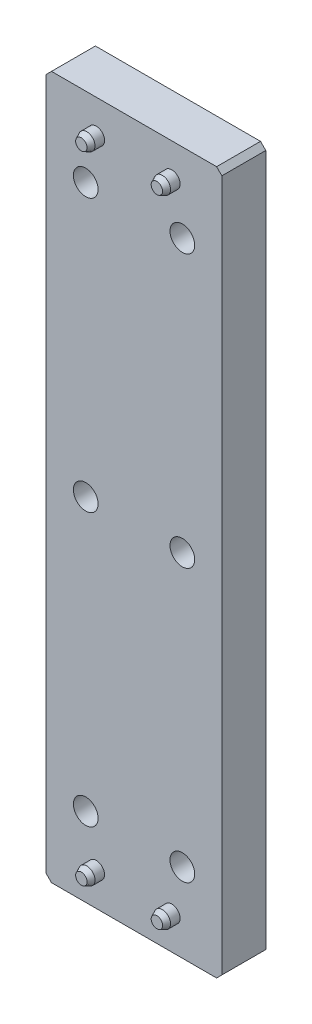
ISO-10303-21;
HEADER;
FILE_DESCRIPTION(('STEP AP214'),'2;1');
FILE_NAME('part.step','',(''),(''),'','','');
FILE_SCHEMA(('AUTOMOTIVE_DESIGN { 1 0 10303 214 1 1 1 1 }'));
ENDSEC;
DATA;
#1=APPLICATION_CONTEXT('core data for automotive mechanical design processes');
#2=APPLICATION_PROTOCOL_DEFINITION('international standard','automotive_design',2000,#1);
#3=PRODUCT_CONTEXT('',#1,'mechanical');
#4=PRODUCT('Part','Part','',(#3));
#5=PRODUCT_RELATED_PRODUCT_CATEGORY('part','',(#4));
#6=PRODUCT_DEFINITION_FORMATION('','',#4);
#7=PRODUCT_DEFINITION_CONTEXT('part definition',#1,'design');
#8=PRODUCT_DEFINITION('design','',#6,#7);
#9=PRODUCT_DEFINITION_SHAPE('','',#8);
#10=(LENGTH_UNIT() NAMED_UNIT(*) SI_UNIT(.MILLI.,.METRE.));
#11=(NAMED_UNIT(*) PLANE_ANGLE_UNIT() SI_UNIT($,.RADIAN.));
#12=(NAMED_UNIT(*) SI_UNIT($,.STERADIAN.) SOLID_ANGLE_UNIT());
#13=UNCERTAINTY_MEASURE_WITH_UNIT(LENGTH_MEASURE(1.E-05),#10,'distance_accuracy_value','');
#14=(GEOMETRIC_REPRESENTATION_CONTEXT(3) GLOBAL_UNCERTAINTY_ASSIGNED_CONTEXT((#13)) GLOBAL_UNIT_ASSIGNED_CONTEXT((#10,
#11,#12)) REPRESENTATION_CONTEXT('',''));
#15=CARTESIAN_POINT('',(0.,0.,0.));
#16=DIRECTION('',(0.,0.,1.));
#17=DIRECTION('',(1.,0.,0.));
#18=AXIS2_PLACEMENT_3D('',#15,#16,#17);
#19=CARTESIAN_POINT('',(10.922,-91.948,-5.20700000000002));
#20=DIRECTION('',(0.,0.,1.));
#21=DIRECTION('',(-1.,0.,0.));
#22=AXIS2_PLACEMENT_3D('',#19,#20,#21);
#23=PLANE('',#22);
#24=CARTESIAN_POINT('',(10.922,-91.948,-5.20700000000002));
#25=DIRECTION('',(0.,0.,1.));
#26=DIRECTION('',(-1.,0.,0.));
#27=AXIS2_PLACEMENT_3D('',#24,#25,#26);
#28=CIRCLE('',#27,2.1209);
#29=CARTESIAN_POINT('',(8.80109999999999,-91.948,-5.20700000000002));
#30=VERTEX_POINT('',#29);
#31=EDGE_CURVE('E71',#30,#30,#28,.T.);
#32=ORIENTED_EDGE('',*,*,#31,.F.);
#33=EDGE_LOOP('',(#32));
#34=FACE_BOUND('',#33,.T.);
#35=ADVANCED_FACE('F57',(#34),#23,.F.);
#36=CARTESIAN_POINT('',(10.922,-91.948,10.668));
#37=DIRECTION('',(0.,0.,-1.));
#38=DIRECTION('',(1.,0.,0.));
#39=AXIS2_PLACEMENT_3D('',#36,#37,#38);
#40=PLANE('',#39);
#41=CARTESIAN_POINT('',(10.922,-91.948,10.668));
#42=DIRECTION('',(0.,0.,1.));
#43=DIRECTION('',(-1.,0.,0.));
#44=AXIS2_PLACEMENT_3D('',#41,#42,#43);
#45=CIRCLE('',#44,1.64944869993752);
#46=CARTESIAN_POINT('',(9.27255130006246,-91.948,10.668));
#47=VERTEX_POINT('',#46);
#48=EDGE_CURVE('E13',#47,#47,#45,.T.);
#49=ORIENTED_EDGE('',*,*,#48,.T.);
#50=EDGE_LOOP('',(#49));
#51=FACE_BOUND('',#50,.T.);
#52=ADVANCED_FACE('F80',(#51),#40,.F.);
#53=CARTESIAN_POINT('',(10.922,-91.948,9.0932));
#54=DIRECTION('',(0.,0.,-1.));
#55=DIRECTION('',(1.,0.,0.));
#56=AXIS2_PLACEMENT_3D('',#53,#54,#55);
#57=CONICAL_SURFACE('',#56,2.38379,0.436332312998575);
#58=ORIENTED_EDGE('',*,*,#48,.F.);
#59=EDGE_LOOP('',(#58));
#60=FACE_BOUND('',#59,.T.);
#61=CARTESIAN_POINT('',(10.922,-91.948,9.0932));
#62=DIRECTION('',(0.,0.,1.));
#63=DIRECTION('',(-1.,0.,0.));
#64=AXIS2_PLACEMENT_3D('',#61,#62,#63);
#65=CIRCLE('',#64,2.38379);
#66=CARTESIAN_POINT('',(8.53820999999999,-91.948,9.0932));
#67=VERTEX_POINT('',#66);
#68=EDGE_CURVE('E63',#67,#67,#65,.T.);
#69=ORIENTED_EDGE('',*,*,#68,.T.);
#70=EDGE_LOOP('',(#69));
#71=FACE_BOUND('',#70,.T.);
#72=ADVANCED_FACE('F84',(#60,#71),#57,.T.);
#73=CARTESIAN_POINT('',(10.922,-91.948,-5.20700000000002));
#74=DIRECTION('',(0.,0.,1.));
#75=DIRECTION('',(-1.,0.,0.));
#76=AXIS2_PLACEMENT_3D('',#73,#74,#75);
#77=CYLINDRICAL_SURFACE('',#76,2.38379);
#78=ORIENTED_EDGE('',*,*,#68,.F.);
#79=EDGE_LOOP('',(#78));
#80=FACE_BOUND('',#79,.T.);
#81=CARTESIAN_POINT('',(10.922,-91.948,-1.44749784777304));
#82=DIRECTION('',(0.,0.,1.));
#83=DIRECTION('',(-1.,0.,0.));
#84=AXIS2_PLACEMENT_3D('',#81,#82,#83);
#85=CIRCLE('',#84,2.38379);
#86=CARTESIAN_POINT('',(8.53820999999999,-91.948,-1.44749784777304));
#87=VERTEX_POINT('',#86);
#88=EDGE_CURVE('E67',#87,#87,#85,.T.);
#89=ORIENTED_EDGE('',*,*,#88,.T.);
#90=EDGE_LOOP('',(#89));
#91=FACE_BOUND('',#90,.T.);
#92=ADVANCED_FACE('F88',(#80,#91),#77,.T.);
#93=CARTESIAN_POINT('',(10.922,-91.948,-5.20700000000002));
#94=DIRECTION('',(0.,0.,1.));
#95=DIRECTION('',(-1.,0.,0.));
#96=AXIS2_PLACEMENT_3D('',#93,#94,#95);
#97=CONICAL_SURFACE('',#96,2.1209,0.0698131700797735);
#98=ORIENTED_EDGE('',*,*,#88,.F.);
#99=EDGE_LOOP('',(#98));
#100=FACE_BOUND('',#99,.T.);
#101=ORIENTED_EDGE('',*,*,#31,.T.);
#102=EDGE_LOOP('',(#101));
#103=FACE_BOUND('',#102,.T.);
#104=ADVANCED_FACE('F77',(#100,#103),#97,.T.);
#105=CLOSED_SHELL('',(#35,#52,#72,#92,#104));
#106=MANIFOLD_SOLID_BREP('B2',#105);
#107=CARTESIAN_POINT('',(-10.922,-91.948,-5.20700000000005));
#108=DIRECTION('',(0.,0.,1.));
#109=DIRECTION('',(-1.,0.,0.));
#110=AXIS2_PLACEMENT_3D('',#107,#108,#109);
#111=PLANE('',#110);
#112=CARTESIAN_POINT('',(-10.922,-91.948,-5.20700000000005));
#113=DIRECTION('',(0.,0.,1.));
#114=DIRECTION('',(-1.,0.,0.));
#115=AXIS2_PLACEMENT_3D('',#112,#113,#114);
#116=CIRCLE('',#115,2.1209);
#117=CARTESIAN_POINT('',(-13.0429,-91.948,-5.20700000000005));
#118=VERTEX_POINT('',#117);
#119=EDGE_CURVE('E157',#118,#118,#116,.T.);
#120=ORIENTED_EDGE('',*,*,#119,.F.);
#121=EDGE_LOOP('',(#120));
#122=FACE_BOUND('',#121,.T.);
#123=ADVANCED_FACE('F143',(#122),#111,.F.);
#124=CARTESIAN_POINT('',(-10.922,-91.948,10.668));
#125=DIRECTION('',(0.,0.,-1.));
#126=DIRECTION('',(1.,0.,0.));
#127=AXIS2_PLACEMENT_3D('',#124,#125,#126);
#128=PLANE('',#127);
#129=CARTESIAN_POINT('',(-10.922,-91.948,10.668));
#130=DIRECTION('',(0.,0.,1.));
#131=DIRECTION('',(-1.,0.,0.));
#132=AXIS2_PLACEMENT_3D('',#129,#130,#131);
#133=CIRCLE('',#132,1.64944869993752);
#134=CARTESIAN_POINT('',(-12.5714486999375,-91.948,10.668));
#135=VERTEX_POINT('',#134);
#136=EDGE_CURVE('E56',#135,#135,#133,.T.);
#137=ORIENTED_EDGE('',*,*,#136,.T.);
#138=EDGE_LOOP('',(#137));
#139=FACE_BOUND('',#138,.T.);
#140=ADVANCED_FACE('F166',(#139),#128,.F.);
#141=CARTESIAN_POINT('',(-10.922,-91.948,9.09319999999997));
#142=DIRECTION('',(0.,0.,-1.));
#143=DIRECTION('',(1.,0.,0.));
#144=AXIS2_PLACEMENT_3D('',#141,#142,#143);
#145=CONICAL_SURFACE('',#144,2.38379,0.436332312998575);
#146=ORIENTED_EDGE('',*,*,#136,.F.);
#147=EDGE_LOOP('',(#146));
#148=FACE_BOUND('',#147,.T.);
#149=CARTESIAN_POINT('',(-10.922,-91.948,9.09319999999997));
#150=DIRECTION('',(0.,0.,1.));
#151=DIRECTION('',(-1.,0.,0.));
#152=AXIS2_PLACEMENT_3D('',#149,#150,#151);
#153=CIRCLE('',#152,2.38379);
#154=CARTESIAN_POINT('',(-13.30579,-91.948,9.09319999999997));
#155=VERTEX_POINT('',#154);
#156=EDGE_CURVE('E149',#155,#155,#153,.T.);
#157=ORIENTED_EDGE('',*,*,#156,.T.);
#158=EDGE_LOOP('',(#157));
#159=FACE_BOUND('',#158,.T.);
#160=ADVANCED_FACE('F170',(#148,#159),#145,.T.);
#161=CARTESIAN_POINT('',(-10.922,-91.948,-5.20700000000005));
#162=DIRECTION('',(0.,0.,1.));
#163=DIRECTION('',(-1.,0.,0.));
#164=AXIS2_PLACEMENT_3D('',#161,#162,#163);
#165=CYLINDRICAL_SURFACE('',#164,2.38379);
#166=ORIENTED_EDGE('',*,*,#156,.F.);
#167=EDGE_LOOP('',(#166));
#168=FACE_BOUND('',#167,.T.);
#169=CARTESIAN_POINT('',(-10.922,-91.948,-1.44749784777307));
#170=DIRECTION('',(0.,0.,1.));
#171=DIRECTION('',(-1.,0.,0.));
#172=AXIS2_PLACEMENT_3D('',#169,#170,#171);
#173=CIRCLE('',#172,2.38379);
#174=CARTESIAN_POINT('',(-13.30579,-91.948,-1.44749784777307));
#175=VERTEX_POINT('',#174);
#176=EDGE_CURVE('E153',#175,#175,#173,.T.);
#177=ORIENTED_EDGE('',*,*,#176,.T.);
#178=EDGE_LOOP('',(#177));
#179=FACE_BOUND('',#178,.T.);
#180=ADVANCED_FACE('F174',(#168,#179),#165,.T.);
#181=CARTESIAN_POINT('',(-10.922,-91.948,-5.20700000000005));
#182=DIRECTION('',(0.,0.,1.));
#183=DIRECTION('',(-1.,0.,0.));
#184=AXIS2_PLACEMENT_3D('',#181,#182,#183);
#185=CONICAL_SURFACE('',#184,2.1209,0.0698131700797735);
#186=ORIENTED_EDGE('',*,*,#176,.F.);
#187=EDGE_LOOP('',(#186));
#188=FACE_BOUND('',#187,.T.);
#189=ORIENTED_EDGE('',*,*,#119,.T.);
#190=EDGE_LOOP('',(#189));
#191=FACE_BOUND('',#190,.T.);
#192=ADVANCED_FACE('F163',(#188,#191),#185,.T.);
#193=CLOSED_SHELL('',(#123,#140,#160,#180,#192));
#194=MANIFOLD_SOLID_BREP('B8',#193);
#195=CARTESIAN_POINT('',(10.9219999999999,91.948,-5.20700000000002));
#196=DIRECTION('',(0.,0.,1.));
#197=DIRECTION('',(-1.,0.,0.));
#198=AXIS2_PLACEMENT_3D('',#195,#196,#197);
#199=PLANE('',#198);
#200=CARTESIAN_POINT('',(10.9219999999999,91.948,-5.20700000000002));
#201=DIRECTION('',(0.,0.,1.));
#202=DIRECTION('',(-1.,0.,0.));
#203=AXIS2_PLACEMENT_3D('',#200,#201,#202);
#204=CIRCLE('',#203,2.1209);
#205=CARTESIAN_POINT('',(8.80109999999987,91.948,-5.20700000000002));
#206=VERTEX_POINT('',#205);
#207=EDGE_CURVE('E243',#206,#206,#204,.T.);
#208=ORIENTED_EDGE('',*,*,#207,.F.);
#209=EDGE_LOOP('',(#208));
#210=FACE_BOUND('',#209,.T.);
#211=ADVANCED_FACE('F229',(#210),#199,.F.);
#212=CARTESIAN_POINT('',(10.9219999999999,91.948,10.668));
#213=DIRECTION('',(0.,0.,-1.));
#214=DIRECTION('',(1.,0.,0.));
#215=AXIS2_PLACEMENT_3D('',#212,#213,#214);
#216=PLANE('',#215);
#217=CARTESIAN_POINT('',(10.9219999999999,91.948,10.668));
#218=DIRECTION('',(0.,0.,1.));
#219=DIRECTION('',(-1.,0.,0.));
#220=AXIS2_PLACEMENT_3D('',#217,#218,#219);
#221=CIRCLE('',#220,1.64944869993752);
#222=CARTESIAN_POINT('',(9.27255130006235,91.948,10.668));
#223=VERTEX_POINT('',#222);
#224=EDGE_CURVE('E142',#223,#223,#221,.T.);
#225=ORIENTED_EDGE('',*,*,#224,.T.);
#226=EDGE_LOOP('',(#225));
#227=FACE_BOUND('',#226,.T.);
#228=ADVANCED_FACE('F252',(#227),#216,.F.);
#229=CARTESIAN_POINT('',(10.9219999999999,91.948,9.0932));
#230=DIRECTION('',(0.,0.,-1.));
#231=DIRECTION('',(1.,0.,0.));
#232=AXIS2_PLACEMENT_3D('',#229,#230,#231);
#233=CONICAL_SURFACE('',#232,2.38379,0.436332312998575);
#234=ORIENTED_EDGE('',*,*,#224,.F.);
#235=EDGE_LOOP('',(#234));
#236=FACE_BOUND('',#235,.T.);
#237=CARTESIAN_POINT('',(10.9219999999999,91.948,9.0932));
#238=DIRECTION('',(0.,0.,1.));
#239=DIRECTION('',(-1.,0.,0.));
#240=AXIS2_PLACEMENT_3D('',#237,#238,#239);
#241=CIRCLE('',#240,2.38379);
#242=CARTESIAN_POINT('',(8.53820999999988,91.948,9.0932));
#243=VERTEX_POINT('',#242);
#244=EDGE_CURVE('E235',#243,#243,#241,.T.);
#245=ORIENTED_EDGE('',*,*,#244,.T.);
#246=EDGE_LOOP('',(#245));
#247=FACE_BOUND('',#246,.T.);
#248=ADVANCED_FACE('F256',(#236,#247),#233,.T.);
#249=CARTESIAN_POINT('',(10.9219999999999,91.948,-5.20700000000002));
#250=DIRECTION('',(0.,0.,1.));
#251=DIRECTION('',(-1.,0.,0.));
#252=AXIS2_PLACEMENT_3D('',#249,#250,#251);
#253=CYLINDRICAL_SURFACE('',#252,2.38379);
#254=ORIENTED_EDGE('',*,*,#244,.F.);
#255=EDGE_LOOP('',(#254));
#256=FACE_BOUND('',#255,.T.);
#257=CARTESIAN_POINT('',(10.9219999999999,91.948,-1.44749784777304));
#258=DIRECTION('',(0.,0.,1.));
#259=DIRECTION('',(-1.,0.,0.));
#260=AXIS2_PLACEMENT_3D('',#257,#258,#259);
#261=CIRCLE('',#260,2.38379);
#262=CARTESIAN_POINT('',(8.53820999999987,91.948,-1.44749784777304));
#263=VERTEX_POINT('',#262);
#264=EDGE_CURVE('E239',#263,#263,#261,.T.);
#265=ORIENTED_EDGE('',*,*,#264,.T.);
#266=EDGE_LOOP('',(#265));
#267=FACE_BOUND('',#266,.T.);
#268=ADVANCED_FACE('F260',(#256,#267),#253,.T.);
#269=CARTESIAN_POINT('',(10.9219999999999,91.948,-5.20700000000002));
#270=DIRECTION('',(0.,0.,1.));
#271=DIRECTION('',(-1.,0.,0.));
#272=AXIS2_PLACEMENT_3D('',#269,#270,#271);
#273=CONICAL_SURFACE('',#272,2.1209,0.0698131700797735);
#274=ORIENTED_EDGE('',*,*,#264,.F.);
#275=EDGE_LOOP('',(#274));
#276=FACE_BOUND('',#275,.T.);
#277=ORIENTED_EDGE('',*,*,#207,.T.);
#278=EDGE_LOOP('',(#277));
#279=FACE_BOUND('',#278,.T.);
#280=ADVANCED_FACE('F249',(#276,#279),#273,.T.);
#281=CLOSED_SHELL('',(#211,#228,#248,#268,#280));
#282=MANIFOLD_SOLID_BREP('B51',#281);
#283=CARTESIAN_POINT('',(-10.922,91.9480000000001,-5.20700000000002));
#284=DIRECTION('',(0.,0.,1.));
#285=DIRECTION('',(-1.,0.,0.));
#286=AXIS2_PLACEMENT_3D('',#283,#284,#285);
#287=PLANE('',#286);
#288=CARTESIAN_POINT('',(-10.922,91.9480000000001,-5.20700000000002));
#289=DIRECTION('',(0.,0.,1.));
#290=DIRECTION('',(-1.,0.,0.));
#291=AXIS2_PLACEMENT_3D('',#288,#289,#290);
#292=CIRCLE('',#291,2.1209);
#293=CARTESIAN_POINT('',(-13.0429,91.9480000000001,-5.20700000000002));
#294=VERTEX_POINT('',#293);
#295=EDGE_CURVE('E330',#294,#294,#292,.T.);
#296=ORIENTED_EDGE('',*,*,#295,.F.);
#297=EDGE_LOOP('',(#296));
#298=FACE_BOUND('',#297,.T.);
#299=ADVANCED_FACE('F316',(#298),#287,.F.);
#300=CARTESIAN_POINT('',(-10.922,91.9480000000001,10.668));
#301=DIRECTION('',(0.,0.,-1.));
#302=DIRECTION('',(1.,0.,0.));
#303=AXIS2_PLACEMENT_3D('',#300,#301,#302);
#304=PLANE('',#303);
#305=CARTESIAN_POINT('',(-10.922,91.9480000000001,10.668));
#306=DIRECTION('',(0.,0.,1.));
#307=DIRECTION('',(-1.,0.,0.));
#308=AXIS2_PLACEMENT_3D('',#305,#306,#307);
#309=CIRCLE('',#308,1.64944869993752);
#310=CARTESIAN_POINT('',(-12.5714486999375,91.9480000000001,10.668));
#311=VERTEX_POINT('',#310);
#312=EDGE_CURVE('E228',#311,#311,#309,.T.);
#313=ORIENTED_EDGE('',*,*,#312,.T.);
#314=EDGE_LOOP('',(#313));
#315=FACE_BOUND('',#314,.T.);
#316=ADVANCED_FACE('F339',(#315),#304,.F.);
#317=CARTESIAN_POINT('',(-10.922,91.9480000000001,9.0932));
#318=DIRECTION('',(0.,0.,-1.));
#319=DIRECTION('',(1.,0.,0.));
#320=AXIS2_PLACEMENT_3D('',#317,#318,#319);
#321=CONICAL_SURFACE('',#320,2.38379,0.436332312998575);
#322=ORIENTED_EDGE('',*,*,#312,.F.);
#323=EDGE_LOOP('',(#322));
#324=FACE_BOUND('',#323,.T.);
#325=CARTESIAN_POINT('',(-10.922,91.9480000000001,9.0932));
#326=DIRECTION('',(0.,0.,1.));
#327=DIRECTION('',(-1.,0.,0.));
#328=AXIS2_PLACEMENT_3D('',#325,#326,#327);
#329=CIRCLE('',#328,2.38379);
#330=CARTESIAN_POINT('',(-13.30579,91.9480000000001,9.0932));
#331=VERTEX_POINT('',#330);
#332=EDGE_CURVE('E322',#331,#331,#329,.T.);
#333=ORIENTED_EDGE('',*,*,#332,.T.);
#334=EDGE_LOOP('',(#333));
#335=FACE_BOUND('',#334,.T.);
#336=ADVANCED_FACE('F343',(#324,#335),#321,.T.);
#337=CARTESIAN_POINT('',(-10.922,91.9480000000001,-5.20700000000002));
#338=DIRECTION('',(0.,0.,1.));
#339=DIRECTION('',(-1.,0.,0.));
#340=AXIS2_PLACEMENT_3D('',#337,#338,#339);
#341=CYLINDRICAL_SURFACE('',#340,2.38379);
#342=ORIENTED_EDGE('',*,*,#332,.F.);
#343=EDGE_LOOP('',(#342));
#344=FACE_BOUND('',#343,.T.);
#345=CARTESIAN_POINT('',(-10.922,91.9480000000001,-1.44749784777304));
#346=DIRECTION('',(0.,0.,1.));
#347=DIRECTION('',(-1.,0.,0.));
#348=AXIS2_PLACEMENT_3D('',#345,#346,#347);
#349=CIRCLE('',#348,2.38379);
#350=CARTESIAN_POINT('',(-13.30579,91.9480000000001,-1.44749784777304));
#351=VERTEX_POINT('',#350);
#352=EDGE_CURVE('E326',#351,#351,#349,.T.);
#353=ORIENTED_EDGE('',*,*,#352,.T.);
#354=EDGE_LOOP('',(#353));
#355=FACE_BOUND('',#354,.T.);
#356=ADVANCED_FACE('F347',(#344,#355),#341,.T.);
#357=CARTESIAN_POINT('',(-10.922,91.9480000000001,-5.20700000000002));
#358=DIRECTION('',(0.,0.,1.));
#359=DIRECTION('',(-1.,0.,0.));
#360=AXIS2_PLACEMENT_3D('',#357,#358,#359);
#361=CONICAL_SURFACE('',#360,2.1209,0.0698131700797735);
#362=ORIENTED_EDGE('',*,*,#352,.F.);
#363=EDGE_LOOP('',(#362));
#364=FACE_BOUND('',#363,.T.);
#365=ORIENTED_EDGE('',*,*,#295,.T.);
#366=EDGE_LOOP('',(#365));
#367=FACE_BOUND('',#366,.T.);
#368=ADVANCED_FACE('F336',(#364,#367),#361,.T.);
#369=CLOSED_SHELL('',(#299,#316,#336,#356,#368));
#370=MANIFOLD_SOLID_BREP('B137',#369);
#371=CARTESIAN_POINT('',(25.4,101.6,-6.35));
#372=DIRECTION('',(1.,0.,0.));
#373=DIRECTION('',(0.,0.,-1.));
#374=AXIS2_PLACEMENT_3D('',#371,#372,#373);
#375=PLANE('',#374);
#376=DIRECTION('',(0.,1.,0.));
#377=VECTOR('',#376,1.);
#378=CARTESIAN_POINT('',(25.4,101.6,6.35));
#379=LINE('',#378,#377);
#380=CARTESIAN_POINT('',(25.4,-100.076,6.35));
#381=VERTEX_POINT('',#380);
#382=CARTESIAN_POINT('',(25.4,100.076,6.35));
#383=VERTEX_POINT('',#382);
#384=EDGE_CURVE('E515',#381,#383,#379,.T.);
#385=ORIENTED_EDGE('',*,*,#384,.F.);
#386=DIRECTION('',(0.,0.,-1.));
#387=VECTOR('',#386,1.);
#388=CARTESIAN_POINT('',(25.4,-100.076,-6.35));
#389=LINE('',#388,#387);
#390=CARTESIAN_POINT('',(25.4,-100.076,-6.35));
#391=VERTEX_POINT('',#390);
#392=EDGE_CURVE('E506',#381,#391,#389,.T.);
#393=ORIENTED_EDGE('',*,*,#392,.T.);
#394=DIRECTION('',(0.,1.,0.));
#395=VECTOR('',#394,1.);
#396=CARTESIAN_POINT('',(25.4,101.6,-6.35));
#397=LINE('',#396,#395);
#398=CARTESIAN_POINT('',(25.4,100.076,-6.35));
#399=VERTEX_POINT('',#398);
#400=EDGE_CURVE('E512',#391,#399,#397,.T.);
#401=ORIENTED_EDGE('',*,*,#400,.T.);
#402=DIRECTION('',(0.,0.,1.));
#403=VECTOR('',#402,1.);
#404=CARTESIAN_POINT('',(25.4,100.076,-6.35));
#405=LINE('',#404,#403);
#406=EDGE_CURVE('E503',#399,#383,#405,.T.);
#407=ORIENTED_EDGE('',*,*,#406,.T.);
#408=EDGE_LOOP('',(#385,#393,#401,#407));
#409=FACE_BOUND('',#408,.T.);
#410=ADVANCED_FACE('F392',(#409),#375,.T.);
#411=CARTESIAN_POINT('',(25.4,-101.6,-6.35));
#412=DIRECTION('',(0.,-1.,0.));
#413=DIRECTION('',(0.,0.,-1.));
#414=AXIS2_PLACEMENT_3D('',#411,#412,#413);
#415=PLANE('',#414);
#416=DIRECTION('',(1.,0.,0.));
#417=VECTOR('',#416,1.);
#418=CARTESIAN_POINT('',(25.4,-101.6,6.35));
#419=LINE('',#418,#417);
#420=CARTESIAN_POINT('',(-23.876,-101.6,6.35));
#421=VERTEX_POINT('',#420);
#422=CARTESIAN_POINT('',(23.876,-101.6,6.35));
#423=VERTEX_POINT('',#422);
#424=EDGE_CURVE('E476',#421,#423,#419,.T.);
#425=ORIENTED_EDGE('',*,*,#424,.F.);
#426=DIRECTION('',(0.,0.,-1.));
#427=VECTOR('',#426,1.);
#428=CARTESIAN_POINT('',(-23.876,-101.6,-6.35));
#429=LINE('',#428,#427);
#430=CARTESIAN_POINT('',(-23.876,-101.6,-6.35));
#431=VERTEX_POINT('',#430);
#432=EDGE_CURVE('E494',#421,#431,#429,.T.);
#433=ORIENTED_EDGE('',*,*,#432,.T.);
#434=DIRECTION('',(1.,0.,0.));
#435=VECTOR('',#434,1.);
#436=CARTESIAN_POINT('',(25.4,-101.6,-6.35));
#437=LINE('',#436,#435);
#438=CARTESIAN_POINT('',(23.876,-101.6,-6.35));
#439=VERTEX_POINT('',#438);
#440=EDGE_CURVE('E479',#431,#439,#437,.T.);
#441=ORIENTED_EDGE('',*,*,#440,.T.);
#442=DIRECTION('',(0.,0.,1.));
#443=VECTOR('',#442,1.);
#444=CARTESIAN_POINT('',(23.876,-101.6,-6.35));
#445=LINE('',#444,#443);
#446=EDGE_CURVE('E491',#439,#423,#445,.T.);
#447=ORIENTED_EDGE('',*,*,#446,.T.);
#448=EDGE_LOOP('',(#425,#433,#441,#447));
#449=FACE_BOUND('',#448,.T.);
#450=ADVANCED_FACE('F528',(#449),#415,.T.);
#451=CARTESIAN_POINT('',(-25.4,101.6,-6.35));
#452=DIRECTION('',(-1.,0.,0.));
#453=DIRECTION('',(0.,0.,1.));
#454=AXIS2_PLACEMENT_3D('',#451,#452,#453);
#455=PLANE('',#454);
#456=DIRECTION('',(0.,-1.,0.));
#457=VECTOR('',#456,1.);
#458=CARTESIAN_POINT('',(-25.4,101.6,-6.35));
#459=LINE('',#458,#457);
#460=CARTESIAN_POINT('',(-25.4,100.076,-6.35));
#461=VERTEX_POINT('',#460);
#462=CARTESIAN_POINT('',(-25.4,-100.076,-6.35));
#463=VERTEX_POINT('',#462);
#464=EDGE_CURVE('E483',#461,#463,#459,.T.);
#465=ORIENTED_EDGE('',*,*,#464,.T.);
#466=DIRECTION('',(0.,0.,1.));
#467=VECTOR('',#466,1.);
#468=CARTESIAN_POINT('',(-25.4,-100.076,-6.35));
#469=LINE('',#468,#467);
#470=CARTESIAN_POINT('',(-25.4,-100.076,6.35));
#471=VERTEX_POINT('',#470);
#472=EDGE_CURVE('E475',#463,#471,#469,.T.);
#473=ORIENTED_EDGE('',*,*,#472,.T.);
#474=DIRECTION('',(0.,-1.,0.));
#475=VECTOR('',#474,1.);
#476=CARTESIAN_POINT('',(-25.4,101.6,6.35));
#477=LINE('',#476,#475);
#478=CARTESIAN_POINT('',(-25.4,100.076,6.35));
#479=VERTEX_POINT('',#478);
#480=EDGE_CURVE('E461',#479,#471,#477,.T.);
#481=ORIENTED_EDGE('',*,*,#480,.F.);
#482=DIRECTION('',(0.,0.,-1.));
#483=VECTOR('',#482,1.);
#484=CARTESIAN_POINT('',(-25.4,100.076,-6.35));
#485=LINE('',#484,#483);
#486=EDGE_CURVE('E473',#479,#461,#485,.T.);
#487=ORIENTED_EDGE('',*,*,#486,.T.);
#488=EDGE_LOOP('',(#465,#473,#481,#487));
#489=FACE_BOUND('',#488,.T.);
#490=ADVANCED_FACE('F472',(#489),#455,.T.);
#491=CARTESIAN_POINT('',(25.4,101.6,-6.35));
#492=DIRECTION('',(0.,1.,0.));
#493=DIRECTION('',(0.,0.,1.));
#494=AXIS2_PLACEMENT_3D('',#491,#492,#493);
#495=PLANE('',#494);
#496=DIRECTION('',(-1.,0.,0.));
#497=VECTOR('',#496,1.);
#498=CARTESIAN_POINT('',(25.4,101.6,-6.35));
#499=LINE('',#498,#497);
#500=CARTESIAN_POINT('',(23.876,101.6,-6.35));
#501=VERTEX_POINT('',#500);
#502=CARTESIAN_POINT('',(-23.876,101.6,-6.35));
#503=VERTEX_POINT('',#502);
#504=EDGE_CURVE('E521',#501,#503,#499,.T.);
#505=ORIENTED_EDGE('',*,*,#504,.T.);
#506=DIRECTION('',(0.,0.,1.));
#507=VECTOR('',#506,1.);
#508=CARTESIAN_POINT('',(-23.876,101.6,-6.35));
#509=LINE('',#508,#507);
#510=CARTESIAN_POINT('',(-23.876,101.6,6.35));
#511=VERTEX_POINT('',#510);
#512=EDGE_CURVE('E314',#503,#511,#509,.T.);
#513=ORIENTED_EDGE('',*,*,#512,.T.);
#514=DIRECTION('',(-1.,0.,0.));
#515=VECTOR('',#514,1.);
#516=CARTESIAN_POINT('',(25.4,101.6,6.35));
#517=LINE('',#516,#515);
#518=CARTESIAN_POINT('',(23.876,101.6,6.35));
#519=VERTEX_POINT('',#518);
#520=EDGE_CURVE('E462',#519,#511,#517,.T.);
#521=ORIENTED_EDGE('',*,*,#520,.F.);
#522=DIRECTION('',(0.,0.,-1.));
#523=VECTOR('',#522,1.);
#524=CARTESIAN_POINT('',(23.876,101.6,-6.35));
#525=LINE('',#524,#523);
#526=EDGE_CURVE('E400',#519,#501,#525,.T.);
#527=ORIENTED_EDGE('',*,*,#526,.T.);
#528=EDGE_LOOP('',(#505,#513,#521,#527));
#529=FACE_BOUND('',#528,.T.);
#530=ADVANCED_FACE('F644',(#529),#495,.T.);
#531=CARTESIAN_POINT('',(0.,0.,-6.35));
#532=DIRECTION('',(0.,0.,-1.));
#533=DIRECTION('',(-1.,0.,0.));
#534=AXIS2_PLACEMENT_3D('',#531,#532,#533);
#535=PLANE('',#534);
#536=CARTESIAN_POINT('',(13.97,78.74,-6.35));
#537=DIRECTION('',(0.,0.,1.));
#538=DIRECTION('',(1.,0.,0.));
#539=AXIS2_PLACEMENT_3D('',#536,#537,#538);
#540=CIRCLE('',#539,3.57124);
#541=CARTESIAN_POINT('',(17.54124,78.74,-6.35));
#542=VERTEX_POINT('',#541);
#543=EDGE_CURVE('E594',#542,#542,#540,.T.);
#544=ORIENTED_EDGE('',*,*,#543,.T.);
#545=EDGE_LOOP('',(#544));
#546=FACE_BOUND('',#545,.T.);
#547=CARTESIAN_POINT('',(13.97,-78.7400000000001,-6.35));
#548=DIRECTION('',(0.,0.,1.));
#549=DIRECTION('',(1.,0.,0.));
#550=AXIS2_PLACEMENT_3D('',#547,#548,#549);
#551=CIRCLE('',#550,3.57124);
#552=CARTESIAN_POINT('',(17.54124,-78.7400000000001,-6.35));
#553=VERTEX_POINT('',#552);
#554=EDGE_CURVE('E588',#553,#553,#551,.T.);
#555=ORIENTED_EDGE('',*,*,#554,.T.);
#556=EDGE_LOOP('',(#555));
#557=FACE_BOUND('',#556,.T.);
#558=CARTESIAN_POINT('',(-13.97,-78.7400000000001,-6.35));
#559=DIRECTION('',(0.,0.,1.));
#560=DIRECTION('',(1.,0.,0.));
#561=AXIS2_PLACEMENT_3D('',#558,#559,#560);
#562=CIRCLE('',#561,3.57124);
#563=CARTESIAN_POINT('',(-10.39876,-78.7400000000001,-6.35));
#564=VERTEX_POINT('',#563);
#565=EDGE_CURVE('E582',#564,#564,#562,.T.);
#566=ORIENTED_EDGE('',*,*,#565,.T.);
#567=EDGE_LOOP('',(#566));
#568=FACE_BOUND('',#567,.T.);
#569=CARTESIAN_POINT('',(-13.97,78.74,-6.35));
#570=DIRECTION('',(0.,0.,1.));
#571=DIRECTION('',(1.,0.,0.));
#572=AXIS2_PLACEMENT_3D('',#569,#570,#571);
#573=CIRCLE('',#572,3.57124);
#574=CARTESIAN_POINT('',(-10.39876,78.74,-6.35));
#575=VERTEX_POINT('',#574);
#576=EDGE_CURVE('E576',#575,#575,#573,.T.);
#577=ORIENTED_EDGE('',*,*,#576,.T.);
#578=EDGE_LOOP('',(#577));
#579=FACE_BOUND('',#578,.T.);
#580=CARTESIAN_POINT('',(13.97,0.,-6.35));
#581=DIRECTION('',(0.,0.,1.));
#582=DIRECTION('',(1.,0.,0.));
#583=AXIS2_PLACEMENT_3D('',#580,#581,#582);
#584=CIRCLE('',#583,3.57124);
#585=CARTESIAN_POINT('',(17.54124,0.,-6.35));
#586=VERTEX_POINT('',#585);
#587=EDGE_CURVE('E570',#586,#586,#584,.T.);
#588=ORIENTED_EDGE('',*,*,#587,.T.);
#589=EDGE_LOOP('',(#588));
#590=FACE_BOUND('',#589,.T.);
#591=CARTESIAN_POINT('',(-13.97,0.,-6.35));
#592=DIRECTION('',(0.,0.,1.));
#593=DIRECTION('',(1.,0.,0.));
#594=AXIS2_PLACEMENT_3D('',#591,#592,#593);
#595=CIRCLE('',#594,3.57124);
#596=CARTESIAN_POINT('',(-10.39876,0.,-6.35));
#597=VERTEX_POINT('',#596);
#598=EDGE_CURVE('E564',#597,#597,#595,.T.);
#599=ORIENTED_EDGE('',*,*,#598,.T.);
#600=EDGE_LOOP('',(#599));
#601=FACE_BOUND('',#600,.T.);
#602=CARTESIAN_POINT('',(10.9219999999999,91.948,-6.35));
#603=DIRECTION('',(0.,0.,1.));
#604=DIRECTION('',(1.,0.,0.));
#605=AXIS2_PLACEMENT_3D('',#602,#603,#604);
#606=CIRCLE('',#605,2.4003);
#607=CARTESIAN_POINT('',(13.3222999999999,91.948,-6.35));
#608=VERTEX_POINT('',#607);
#609=EDGE_CURVE('E558',#608,#608,#606,.T.);
#610=ORIENTED_EDGE('',*,*,#609,.T.);
#611=EDGE_LOOP('',(#610));
#612=FACE_BOUND('',#611,.T.);
#613=CARTESIAN_POINT('',(10.922,-91.948,-6.35));
#614=DIRECTION('',(0.,0.,1.));
#615=DIRECTION('',(1.,0.,0.));
#616=AXIS2_PLACEMENT_3D('',#613,#614,#615);
#617=CIRCLE('',#616,2.4003);
#618=CARTESIAN_POINT('',(13.3223,-91.948,-6.35));
#619=VERTEX_POINT('',#618);
#620=EDGE_CURVE('E552',#619,#619,#617,.T.);
#621=ORIENTED_EDGE('',*,*,#620,.T.);
#622=EDGE_LOOP('',(#621));
#623=FACE_BOUND('',#622,.T.);
#624=CARTESIAN_POINT('',(-10.922,91.948,-6.35));
#625=DIRECTION('',(0.,0.,1.));
#626=DIRECTION('',(1.,0.,0.));
#627=AXIS2_PLACEMENT_3D('',#624,#625,#626);
#628=CIRCLE('',#627,2.4003);
#629=CARTESIAN_POINT('',(-8.52169999999999,91.948,-6.35));
#630=VERTEX_POINT('',#629);
#631=EDGE_CURVE('E544',#630,#630,#628,.T.);
#632=ORIENTED_EDGE('',*,*,#631,.T.);
#633=EDGE_LOOP('',(#632));
#634=FACE_BOUND('',#633,.T.);
#635=CARTESIAN_POINT('',(-10.922,-91.948,-6.35));
#636=DIRECTION('',(0.,0.,1.));
#637=DIRECTION('',(1.,0.,0.));
#638=AXIS2_PLACEMENT_3D('',#635,#636,#637);
#639=CIRCLE('',#638,2.4003);
#640=CARTESIAN_POINT('',(-8.52169999999999,-91.948,-6.35));
#641=VERTEX_POINT('',#640);
#642=EDGE_CURVE('E537',#641,#641,#639,.T.);
#643=ORIENTED_EDGE('',*,*,#642,.T.);
#644=EDGE_LOOP('',(#643));
#645=FACE_BOUND('',#644,.T.);
#646=ORIENTED_EDGE('',*,*,#440,.F.);
#647=DIRECTION('',(0.707106781186548,-0.707106781186548,0.));
#648=VECTOR('',#647,1.);
#649=CARTESIAN_POINT('',(-62.738,-62.738,-6.35));
#650=LINE('',#649,#648);
#651=EDGE_CURVE('E501',#431,#463,#650,.F.);
#652=ORIENTED_EDGE('',*,*,#651,.T.);
#653=ORIENTED_EDGE('',*,*,#464,.F.);
#654=DIRECTION('',(-0.707106781186541,-0.707106781186554,0.));
#655=VECTOR('',#654,1.);
#656=CARTESIAN_POINT('',(-62.7380000000002,62.7379999999991,-6.35));
#657=LINE('',#656,#655);
#658=EDGE_CURVE('E407',#461,#503,#657,.F.);
#659=ORIENTED_EDGE('',*,*,#658,.T.);
#660=ORIENTED_EDGE('',*,*,#504,.F.);
#661=DIRECTION('',(-0.707106781186548,0.707106781186548,0.));
#662=VECTOR('',#661,1.);
#663=CARTESIAN_POINT('',(62.738,62.738,-6.35));
#664=LINE('',#663,#662);
#665=EDGE_CURVE('E496',#501,#399,#664,.F.);
#666=ORIENTED_EDGE('',*,*,#665,.T.);
#667=ORIENTED_EDGE('',*,*,#400,.F.);
#668=DIRECTION('',(0.707106781186541,0.707106781186554,0.));
#669=VECTOR('',#668,1.);
#670=CARTESIAN_POINT('',(62.7380000000002,-62.7379999999991,-6.35));
#671=LINE('',#670,#669);
#672=EDGE_CURVE('E499',#391,#439,#671,.F.);
#673=ORIENTED_EDGE('',*,*,#672,.T.);
#674=EDGE_LOOP('',(#646,#652,#653,#659,#660,#666,#667,#673));
#675=FACE_BOUND('',#674,.T.);
#676=ADVANCED_FACE('F519',(#546,#557,#568,#579,#590,#601,#612,#623,#634,#645,#675),#535,.T.);
#677=CARTESIAN_POINT('',(0.,0.,6.35));
#678=DIRECTION('',(0.,0.,-1.));
#679=DIRECTION('',(-1.,0.,0.));
#680=AXIS2_PLACEMENT_3D('',#677,#678,#679);
#681=PLANE('',#680);
#682=CARTESIAN_POINT('',(13.97,78.74,6.35));
#683=DIRECTION('',(0.,0.,1.));
#684=DIRECTION('',(1.,0.,0.));
#685=AXIS2_PLACEMENT_3D('',#682,#683,#684);
#686=CIRCLE('',#685,3.57124);
#687=CARTESIAN_POINT('',(17.54124,78.74,6.35));
#688=VERTEX_POINT('',#687);
#689=EDGE_CURVE('E597',#688,#688,#686,.T.);
#690=ORIENTED_EDGE('',*,*,#689,.F.);
#691=EDGE_LOOP('',(#690));
#692=FACE_BOUND('',#691,.T.);
#693=CARTESIAN_POINT('',(13.97,-78.7400000000001,6.35));
#694=DIRECTION('',(0.,0.,1.));
#695=DIRECTION('',(1.,0.,0.));
#696=AXIS2_PLACEMENT_3D('',#693,#694,#695);
#697=CIRCLE('',#696,3.57124);
#698=CARTESIAN_POINT('',(17.54124,-78.7400000000001,6.35));
#699=VERTEX_POINT('',#698);
#700=EDGE_CURVE('E591',#699,#699,#697,.T.);
#701=ORIENTED_EDGE('',*,*,#700,.F.);
#702=EDGE_LOOP('',(#701));
#703=FACE_BOUND('',#702,.T.);
#704=CARTESIAN_POINT('',(-13.97,-78.7400000000001,6.35));
#705=DIRECTION('',(0.,0.,1.));
#706=DIRECTION('',(1.,0.,0.));
#707=AXIS2_PLACEMENT_3D('',#704,#705,#706);
#708=CIRCLE('',#707,3.57124);
#709=CARTESIAN_POINT('',(-10.39876,-78.7400000000001,6.35));
#710=VERTEX_POINT('',#709);
#711=EDGE_CURVE('E585',#710,#710,#708,.T.);
#712=ORIENTED_EDGE('',*,*,#711,.F.);
#713=EDGE_LOOP('',(#712));
#714=FACE_BOUND('',#713,.T.);
#715=CARTESIAN_POINT('',(-13.97,78.74,6.35));
#716=DIRECTION('',(0.,0.,1.));
#717=DIRECTION('',(1.,0.,0.));
#718=AXIS2_PLACEMENT_3D('',#715,#716,#717);
#719=CIRCLE('',#718,3.57124);
#720=CARTESIAN_POINT('',(-10.39876,78.74,6.35));
#721=VERTEX_POINT('',#720);
#722=EDGE_CURVE('E579',#721,#721,#719,.T.);
#723=ORIENTED_EDGE('',*,*,#722,.F.);
#724=EDGE_LOOP('',(#723));
#725=FACE_BOUND('',#724,.T.);
#726=CARTESIAN_POINT('',(13.97,0.,6.35));
#727=DIRECTION('',(0.,0.,1.));
#728=DIRECTION('',(1.,0.,0.));
#729=AXIS2_PLACEMENT_3D('',#726,#727,#728);
#730=CIRCLE('',#729,3.57124);
#731=CARTESIAN_POINT('',(17.54124,0.,6.35));
#732=VERTEX_POINT('',#731);
#733=EDGE_CURVE('E573',#732,#732,#730,.T.);
#734=ORIENTED_EDGE('',*,*,#733,.F.);
#735=EDGE_LOOP('',(#734));
#736=FACE_BOUND('',#735,.T.);
#737=CARTESIAN_POINT('',(-13.97,0.,6.35));
#738=DIRECTION('',(0.,0.,1.));
#739=DIRECTION('',(1.,0.,0.));
#740=AXIS2_PLACEMENT_3D('',#737,#738,#739);
#741=CIRCLE('',#740,3.57124);
#742=CARTESIAN_POINT('',(-10.39876,0.,6.35));
#743=VERTEX_POINT('',#742);
#744=EDGE_CURVE('E567',#743,#743,#741,.T.);
#745=ORIENTED_EDGE('',*,*,#744,.F.);
#746=EDGE_LOOP('',(#745));
#747=FACE_BOUND('',#746,.T.);
#748=CARTESIAN_POINT('',(10.9219999999999,91.948,6.35));
#749=DIRECTION('',(0.,0.,1.));
#750=DIRECTION('',(1.,0.,0.));
#751=AXIS2_PLACEMENT_3D('',#748,#749,#750);
#752=CIRCLE('',#751,2.4003);
#753=CARTESIAN_POINT('',(13.3222999999999,91.948,6.35));
#754=VERTEX_POINT('',#753);
#755=EDGE_CURVE('E561',#754,#754,#752,.T.);
#756=ORIENTED_EDGE('',*,*,#755,.F.);
#757=EDGE_LOOP('',(#756));
#758=FACE_BOUND('',#757,.T.);
#759=CARTESIAN_POINT('',(10.922,-91.948,6.35));
#760=DIRECTION('',(0.,0.,1.));
#761=DIRECTION('',(1.,0.,0.));
#762=AXIS2_PLACEMENT_3D('',#759,#760,#761);
#763=CIRCLE('',#762,2.4003);
#764=CARTESIAN_POINT('',(13.3223,-91.948,6.35));
#765=VERTEX_POINT('',#764);
#766=EDGE_CURVE('E555',#765,#765,#763,.T.);
#767=ORIENTED_EDGE('',*,*,#766,.F.);
#768=EDGE_LOOP('',(#767));
#769=FACE_BOUND('',#768,.T.);
#770=CARTESIAN_POINT('',(-10.922,91.948,6.35));
#771=DIRECTION('',(0.,0.,1.));
#772=DIRECTION('',(1.,0.,0.));
#773=AXIS2_PLACEMENT_3D('',#770,#771,#772);
#774=CIRCLE('',#773,2.4003);
#775=CARTESIAN_POINT('',(-8.52169999999999,91.948,6.35));
#776=VERTEX_POINT('',#775);
#777=EDGE_CURVE('E549',#776,#776,#774,.T.);
#778=ORIENTED_EDGE('',*,*,#777,.F.);
#779=EDGE_LOOP('',(#778));
#780=FACE_BOUND('',#779,.T.);
#781=CARTESIAN_POINT('',(-10.922,-91.948,6.35));
#782=DIRECTION('',(0.,0.,1.));
#783=DIRECTION('',(1.,0.,0.));
#784=AXIS2_PLACEMENT_3D('',#781,#782,#783);
#785=CIRCLE('',#784,2.4003);
#786=CARTESIAN_POINT('',(-8.52169999999999,-91.948,6.35));
#787=VERTEX_POINT('',#786);
#788=EDGE_CURVE('E539',#787,#787,#785,.T.);
#789=ORIENTED_EDGE('',*,*,#788,.F.);
#790=EDGE_LOOP('',(#789));
#791=FACE_BOUND('',#790,.T.);
#792=ORIENTED_EDGE('',*,*,#480,.T.);
#793=DIRECTION('',(-0.707106781186548,0.707106781186548,0.));
#794=VECTOR('',#793,1.);
#795=CARTESIAN_POINT('',(-25.4,-100.076,6.35));
#796=LINE('',#795,#794);
#797=EDGE_CURVE('E489',#471,#421,#796,.F.);
#798=ORIENTED_EDGE('',*,*,#797,.T.);
#799=ORIENTED_EDGE('',*,*,#424,.T.);
#800=DIRECTION('',(-0.707106781186541,-0.707106781186554,0.));
#801=VECTOR('',#800,1.);
#802=CARTESIAN_POINT('',(23.876,-101.6,6.35));
#803=LINE('',#802,#801);
#804=EDGE_CURVE('E466',#423,#381,#803,.F.);
#805=ORIENTED_EDGE('',*,*,#804,.T.);
#806=ORIENTED_EDGE('',*,*,#384,.T.);
#807=DIRECTION('',(0.707106781186548,-0.707106781186548,0.));
#808=VECTOR('',#807,1.);
#809=CARTESIAN_POINT('',(25.4,100.076,6.35));
#810=LINE('',#809,#808);
#811=EDGE_CURVE('E467',#383,#519,#810,.F.);
#812=ORIENTED_EDGE('',*,*,#811,.T.);
#813=ORIENTED_EDGE('',*,*,#520,.T.);
#814=DIRECTION('',(0.707106781186541,0.707106781186554,0.));
#815=VECTOR('',#814,1.);
#816=CARTESIAN_POINT('',(-23.876,101.6,6.35));
#817=LINE('',#816,#815);
#818=EDGE_CURVE('E458',#511,#479,#817,.F.);
#819=ORIENTED_EDGE('',*,*,#818,.T.);
#820=EDGE_LOOP('',(#792,#798,#799,#805,#806,#812,#813,#819));
#821=FACE_BOUND('',#820,.T.);
#822=ADVANCED_FACE('F460',(#692,#703,#714,#725,#736,#747,#758,#769,#780,#791,#821),#681,.F.);
#823=CARTESIAN_POINT('',(-10.922,-91.948,6.35));
#824=DIRECTION('',(0.,0.,1.));
#825=DIRECTION('',(1.,0.,0.));
#826=AXIS2_PLACEMENT_3D('',#823,#824,#825);
#827=CYLINDRICAL_SURFACE('',#826,2.4003);
#828=ORIENTED_EDGE('',*,*,#642,.F.);
#829=EDGE_LOOP('',(#828));
#830=FACE_BOUND('',#829,.T.);
#831=ORIENTED_EDGE('',*,*,#788,.T.);
#832=EDGE_LOOP('',(#831));
#833=FACE_BOUND('',#832,.T.);
#834=ADVANCED_FACE('F605',(#830,#833),#827,.F.);
#835=CARTESIAN_POINT('',(-10.922,91.948,6.35));
#836=DIRECTION('',(0.,0.,1.));
#837=DIRECTION('',(1.,0.,0.));
#838=AXIS2_PLACEMENT_3D('',#835,#836,#837);
#839=CYLINDRICAL_SURFACE('',#838,2.4003);
#840=ORIENTED_EDGE('',*,*,#631,.F.);
#841=EDGE_LOOP('',(#840));
#842=FACE_BOUND('',#841,.T.);
#843=ORIENTED_EDGE('',*,*,#777,.T.);
#844=EDGE_LOOP('',(#843));
#845=FACE_BOUND('',#844,.T.);
#846=ADVANCED_FACE('F626',(#842,#845),#839,.F.);
#847=CARTESIAN_POINT('',(10.922,-91.948,6.35));
#848=DIRECTION('',(0.,0.,1.));
#849=DIRECTION('',(1.,0.,0.));
#850=AXIS2_PLACEMENT_3D('',#847,#848,#849);
#851=CYLINDRICAL_SURFACE('',#850,2.4003);
#852=ORIENTED_EDGE('',*,*,#620,.F.);
#853=EDGE_LOOP('',(#852));
#854=FACE_BOUND('',#853,.T.);
#855=ORIENTED_EDGE('',*,*,#766,.T.);
#856=EDGE_LOOP('',(#855));
#857=FACE_BOUND('',#856,.T.);
#858=ADVANCED_FACE('F632',(#854,#857),#851,.F.);
#859=CARTESIAN_POINT('',(10.9219999999999,91.948,6.35));
#860=DIRECTION('',(0.,0.,1.));
#861=DIRECTION('',(1.,0.,0.));
#862=AXIS2_PLACEMENT_3D('',#859,#860,#861);
#863=CYLINDRICAL_SURFACE('',#862,2.4003);
#864=ORIENTED_EDGE('',*,*,#609,.F.);
#865=EDGE_LOOP('',(#864));
#866=FACE_BOUND('',#865,.T.);
#867=ORIENTED_EDGE('',*,*,#755,.T.);
#868=EDGE_LOOP('',(#867));
#869=FACE_BOUND('',#868,.T.);
#870=ADVANCED_FACE('F732',(#866,#869),#863,.F.);
#871=CARTESIAN_POINT('',(-13.97,0.,6.35));
#872=DIRECTION('',(0.,0.,1.));
#873=DIRECTION('',(1.,0.,0.));
#874=AXIS2_PLACEMENT_3D('',#871,#872,#873);
#875=CYLINDRICAL_SURFACE('',#874,3.57124);
#876=ORIENTED_EDGE('',*,*,#598,.F.);
#877=EDGE_LOOP('',(#876));
#878=FACE_BOUND('',#877,.T.);
#879=ORIENTED_EDGE('',*,*,#744,.T.);
#880=EDGE_LOOP('',(#879));
#881=FACE_BOUND('',#880,.T.);
#882=ADVANCED_FACE('F722',(#878,#881),#875,.F.);
#883=CARTESIAN_POINT('',(13.97,0.,6.35));
#884=DIRECTION('',(0.,0.,1.));
#885=DIRECTION('',(1.,0.,0.));
#886=AXIS2_PLACEMENT_3D('',#883,#884,#885);
#887=CYLINDRICAL_SURFACE('',#886,3.57124);
#888=ORIENTED_EDGE('',*,*,#587,.F.);
#889=EDGE_LOOP('',(#888));
#890=FACE_BOUND('',#889,.T.);
#891=ORIENTED_EDGE('',*,*,#733,.T.);
#892=EDGE_LOOP('',(#891));
#893=FACE_BOUND('',#892,.T.);
#894=ADVANCED_FACE('F712',(#890,#893),#887,.F.);
#895=CARTESIAN_POINT('',(-13.97,78.74,6.35));
#896=DIRECTION('',(0.,0.,1.));
#897=DIRECTION('',(1.,0.,0.));
#898=AXIS2_PLACEMENT_3D('',#895,#896,#897);
#899=CYLINDRICAL_SURFACE('',#898,3.57124);
#900=ORIENTED_EDGE('',*,*,#576,.F.);
#901=EDGE_LOOP('',(#900));
#902=FACE_BOUND('',#901,.T.);
#903=ORIENTED_EDGE('',*,*,#722,.T.);
#904=EDGE_LOOP('',(#903));
#905=FACE_BOUND('',#904,.T.);
#906=ADVANCED_FACE('F702',(#902,#905),#899,.F.);
#907=CARTESIAN_POINT('',(-13.97,-78.7400000000001,6.35));
#908=DIRECTION('',(0.,0.,1.));
#909=DIRECTION('',(1.,0.,0.));
#910=AXIS2_PLACEMENT_3D('',#907,#908,#909);
#911=CYLINDRICAL_SURFACE('',#910,3.57124);
#912=ORIENTED_EDGE('',*,*,#565,.F.);
#913=EDGE_LOOP('',(#912));
#914=FACE_BOUND('',#913,.T.);
#915=ORIENTED_EDGE('',*,*,#711,.T.);
#916=EDGE_LOOP('',(#915));
#917=FACE_BOUND('',#916,.T.);
#918=ADVANCED_FACE('F692',(#914,#917),#911,.F.);
#919=CARTESIAN_POINT('',(13.97,-78.7400000000001,6.35));
#920=DIRECTION('',(0.,0.,1.));
#921=DIRECTION('',(1.,0.,0.));
#922=AXIS2_PLACEMENT_3D('',#919,#920,#921);
#923=CYLINDRICAL_SURFACE('',#922,3.57124);
#924=ORIENTED_EDGE('',*,*,#554,.F.);
#925=EDGE_LOOP('',(#924));
#926=FACE_BOUND('',#925,.T.);
#927=ORIENTED_EDGE('',*,*,#700,.T.);
#928=EDGE_LOOP('',(#927));
#929=FACE_BOUND('',#928,.T.);
#930=ADVANCED_FACE('F681',(#926,#929),#923,.F.);
#931=CARTESIAN_POINT('',(13.97,78.74,6.35));
#932=DIRECTION('',(0.,0.,1.));
#933=DIRECTION('',(1.,0.,0.));
#934=AXIS2_PLACEMENT_3D('',#931,#932,#933);
#935=CYLINDRICAL_SURFACE('',#934,3.57124);
#936=ORIENTED_EDGE('',*,*,#543,.F.);
#937=EDGE_LOOP('',(#936));
#938=FACE_BOUND('',#937,.T.);
#939=ORIENTED_EDGE('',*,*,#689,.T.);
#940=EDGE_LOOP('',(#939));
#941=FACE_BOUND('',#940,.T.);
#942=ADVANCED_FACE('F601',(#938,#941),#935,.F.);
#943=CARTESIAN_POINT('',(-25.4,-100.076,-6.35));
#944=DIRECTION('',(0.707106781186548,0.707106781186548,0.));
#945=DIRECTION('',(0.,0.,1.));
#946=AXIS2_PLACEMENT_3D('',#943,#944,#945);
#947=PLANE('',#946);
#948=ORIENTED_EDGE('',*,*,#651,.F.);
#949=ORIENTED_EDGE('',*,*,#432,.F.);
#950=ORIENTED_EDGE('',*,*,#797,.F.);
#951=ORIENTED_EDGE('',*,*,#472,.F.);
#952=EDGE_LOOP('',(#948,#949,#950,#951));
#953=FACE_BOUND('',#952,.T.);
#954=ADVANCED_FACE('F532',(#953),#947,.F.);
#955=CARTESIAN_POINT('',(23.876,-101.6,-6.35));
#956=DIRECTION('',(-0.707106781186554,0.707106781186541,0.));
#957=DIRECTION('',(0.,0.,1.));
#958=AXIS2_PLACEMENT_3D('',#955,#956,#957);
#959=PLANE('',#958);
#960=ORIENTED_EDGE('',*,*,#672,.F.);
#961=ORIENTED_EDGE('',*,*,#392,.F.);
#962=ORIENTED_EDGE('',*,*,#804,.F.);
#963=ORIENTED_EDGE('',*,*,#446,.F.);
#964=EDGE_LOOP('',(#960,#961,#962,#963));
#965=FACE_BOUND('',#964,.T.);
#966=ADVANCED_FACE('F524',(#965),#959,.F.);
#967=CARTESIAN_POINT('',(-23.876,101.6,-6.35));
#968=DIRECTION('',(0.707106781186554,-0.707106781186541,0.));
#969=DIRECTION('',(0.,0.,1.));
#970=AXIS2_PLACEMENT_3D('',#967,#968,#969);
#971=PLANE('',#970);
#972=ORIENTED_EDGE('',*,*,#658,.F.);
#973=ORIENTED_EDGE('',*,*,#486,.F.);
#974=ORIENTED_EDGE('',*,*,#818,.F.);
#975=ORIENTED_EDGE('',*,*,#512,.F.);
#976=EDGE_LOOP('',(#972,#973,#974,#975));
#977=FACE_BOUND('',#976,.T.);
#978=ADVANCED_FACE('F478',(#977),#971,.F.);
#979=CARTESIAN_POINT('',(25.4,100.076,-6.35));
#980=DIRECTION('',(-0.707106781186548,-0.707106781186548,0.));
#981=DIRECTION('',(0.,0.,1.));
#982=AXIS2_PLACEMENT_3D('',#979,#980,#981);
#983=PLANE('',#982);
#984=ORIENTED_EDGE('',*,*,#665,.F.);
#985=ORIENTED_EDGE('',*,*,#526,.F.);
#986=ORIENTED_EDGE('',*,*,#811,.F.);
#987=ORIENTED_EDGE('',*,*,#406,.F.);
#988=EDGE_LOOP('',(#984,#985,#986,#987));
#989=FACE_BOUND('',#988,.T.);
#990=ADVANCED_FACE('F394',(#989),#983,.F.);
#991=CLOSED_SHELL('',(#410,#450,#490,#530,#676,#822,#834,#846,#858,#870,#882,#894,#906,#918,
#930,#942,#954,#966,#978,#990));
#992=MANIFOLD_SOLID_BREP('B223',#991);
#993=ADVANCED_BREP_SHAPE_REPRESENTATION('',(#18,#106,#194,#282,#370,#992),#14);
#994=SHAPE_DEFINITION_REPRESENTATION(#9,#993);
ENDSEC;
END-ISO-10303-21;
